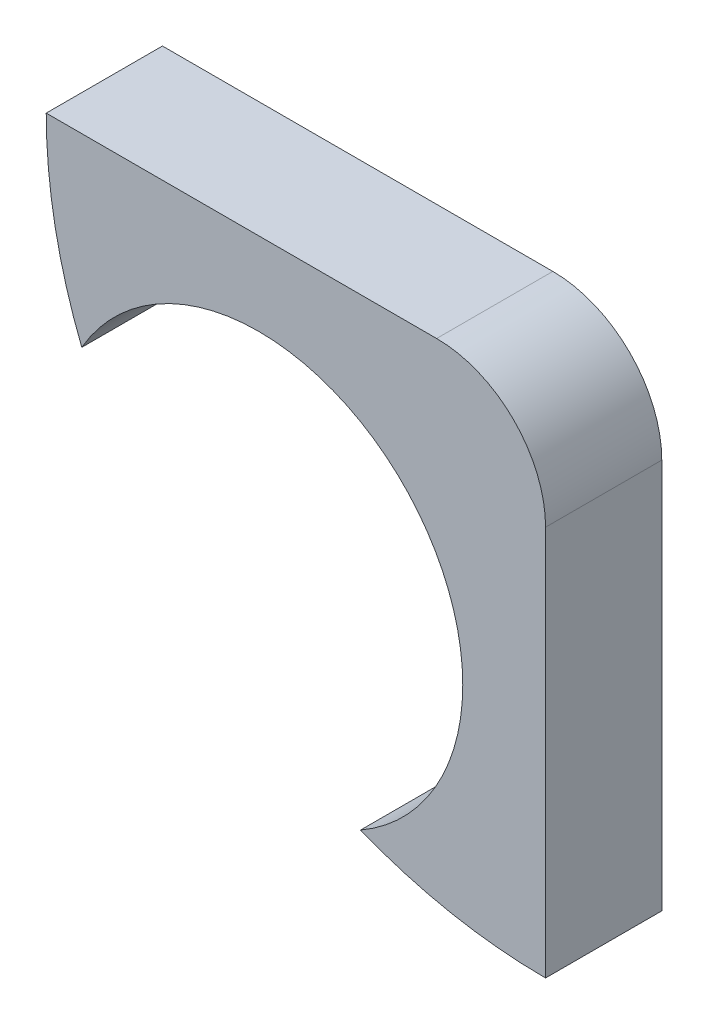
ISO-10303-21;
HEADER;
FILE_DESCRIPTION(('STEP AP214'),'2;1');
FILE_NAME('part.step','',(''),(''),'','','');
FILE_SCHEMA(('AUTOMOTIVE_DESIGN { 1 0 10303 214 1 1 1 1 }'));
ENDSEC;
DATA;
#1=APPLICATION_CONTEXT('core data for automotive mechanical design processes');
#2=APPLICATION_PROTOCOL_DEFINITION('international standard','automotive_design',2000,#1);
#3=PRODUCT_CONTEXT('',#1,'mechanical');
#4=PRODUCT('Part','Part','',(#3));
#5=PRODUCT_RELATED_PRODUCT_CATEGORY('part','',(#4));
#6=PRODUCT_DEFINITION_FORMATION('','',#4);
#7=PRODUCT_DEFINITION_CONTEXT('part definition',#1,'design');
#8=PRODUCT_DEFINITION('design','',#6,#7);
#9=PRODUCT_DEFINITION_SHAPE('','',#8);
#10=(LENGTH_UNIT() NAMED_UNIT(*) SI_UNIT(.MILLI.,.METRE.));
#11=(NAMED_UNIT(*) PLANE_ANGLE_UNIT() SI_UNIT($,.RADIAN.));
#12=(NAMED_UNIT(*) SI_UNIT($,.STERADIAN.) SOLID_ANGLE_UNIT());
#13=UNCERTAINTY_MEASURE_WITH_UNIT(LENGTH_MEASURE(1.E-05),#10,'distance_accuracy_value','');
#14=(GEOMETRIC_REPRESENTATION_CONTEXT(3) GLOBAL_UNCERTAINTY_ASSIGNED_CONTEXT((#13)) GLOBAL_UNIT_ASSIGNED_CONTEXT((#10,
#11,#12)) REPRESENTATION_CONTEXT('',''));
#15=CARTESIAN_POINT('',(0.,0.,0.));
#16=DIRECTION('',(0.,0.,1.));
#17=DIRECTION('',(1.,0.,0.));
#18=AXIS2_PLACEMENT_3D('',#15,#16,#17);
#19=CARTESIAN_POINT('',(18.45,18.45,1.));
#20=DIRECTION('',(0.,0.,-1.));
#21=DIRECTION('',(0.,-1.,0.));
#22=AXIS2_PLACEMENT_3D('',#19,#20,#21);
#23=PLANE('',#22);
#24=CARTESIAN_POINT('',(18.45,18.45,1.));
#25=DIRECTION('',(0.,0.,-1.));
#26=DIRECTION('',(-1.,0.,0.));
#27=AXIS2_PLACEMENT_3D('',#24,#25,#26);
#28=CIRCLE('',#27,1.5);
#29=CARTESIAN_POINT('',(18.45,19.95,1.));
#30=VERTEX_POINT('',#29);
#31=CARTESIAN_POINT('',(19.95,18.45,1.));
#32=VERTEX_POINT('',#31);
#33=EDGE_CURVE('E143',#30,#32,#28,.T.);
#34=ORIENTED_EDGE('',*,*,#33,.F.);
#35=DIRECTION('',(1.,0.,0.));
#36=VECTOR('',#35,1.);
#37=CARTESIAN_POINT('',(13.0749999999998,19.95,1.));
#38=LINE('',#37,#36);
#39=CARTESIAN_POINT('',(13.0749999999998,19.95,1.));
#40=VERTEX_POINT('',#39);
#41=EDGE_CURVE('E20',#40,#30,#38,.T.);
#42=ORIENTED_EDGE('',*,*,#41,.F.);
#43=CARTESIAN_POINT('',(19.95,19.95,1.));
#44=DIRECTION('',(0.,0.,-1.));
#45=DIRECTION('',(-1.,0.,0.));
#46=AXIS2_PLACEMENT_3D('',#43,#44,#45);
#47=CIRCLE('',#46,6.875);
#48=CARTESIAN_POINT('',(13.564657480385,17.4018583423996,1.));
#49=VERTEX_POINT('',#48);
#50=EDGE_CURVE('E138',#49,#40,#47,.T.);
#51=ORIENTED_EDGE('',*,*,#50,.F.);
#52=CARTESIAN_POINT('',(16.,16.,1.));
#53=DIRECTION('',(0.,0.,1.));
#54=DIRECTION('',(-1.,0.,0.));
#55=AXIS2_PLACEMENT_3D('',#52,#53,#54);
#56=CIRCLE('',#55,2.81);
#57=CARTESIAN_POINT('',(18.81,16.,1.));
#58=VERTEX_POINT('',#57);
#59=EDGE_CURVE('E121',#58,#49,#56,.T.);
#60=ORIENTED_EDGE('',*,*,#59,.F.);
#61=CARTESIAN_POINT('',(16.,16.,1.));
#62=DIRECTION('',(0.,0.,1.));
#63=DIRECTION('',(-1.,0.,0.));
#64=AXIS2_PLACEMENT_3D('',#61,#62,#63);
#65=CIRCLE('',#64,2.81);
#66=CARTESIAN_POINT('',(17.4018583423999,13.5646574803852,1.));
#67=VERTEX_POINT('',#66);
#68=EDGE_CURVE('E112',#67,#58,#65,.T.);
#69=ORIENTED_EDGE('',*,*,#68,.F.);
#70=CARTESIAN_POINT('',(19.95,19.95,1.));
#71=DIRECTION('',(0.,0.,-1.));
#72=DIRECTION('',(-1.,0.,0.));
#73=AXIS2_PLACEMENT_3D('',#70,#71,#72);
#74=CIRCLE('',#73,6.875);
#75=CARTESIAN_POINT('',(19.95,13.0750000000002,1.));
#76=VERTEX_POINT('',#75);
#77=EDGE_CURVE('E79',#76,#67,#74,.T.);
#78=ORIENTED_EDGE('',*,*,#77,.F.);
#79=DIRECTION('',(0.,-1.,0.));
#80=VECTOR('',#79,1.);
#81=CARTESIAN_POINT('',(19.95,18.45,1.));
#82=LINE('',#81,#80);
#83=EDGE_CURVE('E163',#32,#76,#82,.T.);
#84=ORIENTED_EDGE('',*,*,#83,.F.);
#85=EDGE_LOOP('',(#34,#42,#51,#60,#69,#78,#84));
#86=FACE_BOUND('',#85,.T.);
#87=ADVANCED_FACE('F16',(#86),#23,.F.);
#88=CARTESIAN_POINT('',(18.45,18.45,-0.6));
#89=DIRECTION('',(0.,0.,-1.));
#90=DIRECTION('',(0.,-1.,0.));
#91=AXIS2_PLACEMENT_3D('',#88,#89,#90);
#92=PLANE('',#91);
#93=CARTESIAN_POINT('',(18.45,18.45,-0.6));
#94=DIRECTION('',(0.,0.,-1.));
#95=DIRECTION('',(-1.,0.,0.));
#96=AXIS2_PLACEMENT_3D('',#93,#94,#95);
#97=CIRCLE('',#96,1.5);
#98=CARTESIAN_POINT('',(18.45,19.95,-0.6));
#99=VERTEX_POINT('',#98);
#100=CARTESIAN_POINT('',(19.95,18.45,-0.6));
#101=VERTEX_POINT('',#100);
#102=EDGE_CURVE('E142',#99,#101,#97,.T.);
#103=ORIENTED_EDGE('',*,*,#102,.T.);
#104=DIRECTION('',(0.,-1.,0.));
#105=VECTOR('',#104,1.);
#106=CARTESIAN_POINT('',(19.95,18.45,-0.6));
#107=LINE('',#106,#105);
#108=CARTESIAN_POINT('',(19.95,13.0750000000002,-0.6));
#109=VERTEX_POINT('',#108);
#110=EDGE_CURVE('E136',#101,#109,#107,.T.);
#111=ORIENTED_EDGE('',*,*,#110,.T.);
#112=CARTESIAN_POINT('',(19.95,19.95,-0.6));
#113=DIRECTION('',(0.,0.,-1.));
#114=DIRECTION('',(-1.,0.,0.));
#115=AXIS2_PLACEMENT_3D('',#112,#113,#114);
#116=CIRCLE('',#115,6.875);
#117=CARTESIAN_POINT('',(17.4018583423999,13.5646574803852,-0.6));
#118=VERTEX_POINT('',#117);
#119=EDGE_CURVE('E64',#109,#118,#116,.T.);
#120=ORIENTED_EDGE('',*,*,#119,.T.);
#121=CARTESIAN_POINT('',(16.,16.,-0.6));
#122=DIRECTION('',(0.,0.,1.));
#123=DIRECTION('',(-1.,0.,0.));
#124=AXIS2_PLACEMENT_3D('',#121,#122,#123);
#125=CIRCLE('',#124,2.81);
#126=CARTESIAN_POINT('',(18.81,16.,-0.6));
#127=VERTEX_POINT('',#126);
#128=EDGE_CURVE('E103',#118,#127,#125,.T.);
#129=ORIENTED_EDGE('',*,*,#128,.T.);
#130=CARTESIAN_POINT('',(16.,16.,-0.6));
#131=DIRECTION('',(0.,0.,1.));
#132=DIRECTION('',(-1.,0.,0.));
#133=AXIS2_PLACEMENT_3D('',#130,#131,#132);
#134=CIRCLE('',#133,2.81);
#135=CARTESIAN_POINT('',(13.564657480385,17.4018583423996,-0.6));
#136=VERTEX_POINT('',#135);
#137=EDGE_CURVE('E108',#127,#136,#134,.T.);
#138=ORIENTED_EDGE('',*,*,#137,.T.);
#139=CARTESIAN_POINT('',(19.95,19.95,-0.6));
#140=DIRECTION('',(0.,0.,-1.));
#141=DIRECTION('',(-1.,0.,0.));
#142=AXIS2_PLACEMENT_3D('',#139,#140,#141);
#143=CIRCLE('',#142,6.875);
#144=CARTESIAN_POINT('',(13.0749999999998,19.95,-0.6));
#145=VERTEX_POINT('',#144);
#146=EDGE_CURVE('E92',#136,#145,#143,.T.);
#147=ORIENTED_EDGE('',*,*,#146,.T.);
#148=DIRECTION('',(1.,0.,0.));
#149=VECTOR('',#148,1.);
#150=CARTESIAN_POINT('',(13.0749999999998,19.95,-0.6));
#151=LINE('',#150,#149);
#152=EDGE_CURVE('E11',#145,#99,#151,.T.);
#153=ORIENTED_EDGE('',*,*,#152,.T.);
#154=EDGE_LOOP('',(#103,#111,#120,#129,#138,#147,#153));
#155=FACE_BOUND('',#154,.T.);
#156=ADVANCED_FACE('F106',(#155),#92,.T.);
#157=CARTESIAN_POINT('',(13.0749999999998,19.95,-0.6));
#158=DIRECTION('',(0.,-1.,0.));
#159=DIRECTION('',(0.,0.,-1.));
#160=AXIS2_PLACEMENT_3D('',#157,#158,#159);
#161=PLANE('',#160);
#162=ORIENTED_EDGE('',*,*,#41,.T.);
#163=DIRECTION('',(0.,0.,1.));
#164=VECTOR('',#163,1.);
#165=CARTESIAN_POINT('',(18.45,19.95,-0.6));
#166=LINE('',#165,#164);
#167=EDGE_CURVE('E153',#99,#30,#166,.T.);
#168=ORIENTED_EDGE('',*,*,#167,.F.);
#169=ORIENTED_EDGE('',*,*,#152,.F.);
#170=DIRECTION('',(0.,0.,1.));
#171=VECTOR('',#170,1.);
#172=CARTESIAN_POINT('',(13.0749999999998,19.95,-0.6));
#173=LINE('',#172,#171);
#174=EDGE_CURVE('E167',#145,#40,#173,.T.);
#175=ORIENTED_EDGE('',*,*,#174,.T.);
#176=EDGE_LOOP('',(#162,#168,#169,#175));
#177=FACE_BOUND('',#176,.T.);
#178=ADVANCED_FACE('F285',(#177),#161,.F.);
#179=CARTESIAN_POINT('',(19.95,19.95,-0.6));
#180=DIRECTION('',(0.,0.,1.));
#181=DIRECTION('',(1.,0.,0.));
#182=AXIS2_PLACEMENT_3D('',#179,#180,#181);
#183=CYLINDRICAL_SURFACE('',#182,6.875);
#184=ORIENTED_EDGE('',*,*,#50,.T.);
#185=ORIENTED_EDGE('',*,*,#174,.F.);
#186=ORIENTED_EDGE('',*,*,#146,.F.);
#187=DIRECTION('',(0.,0.,1.));
#188=VECTOR('',#187,1.);
#189=CARTESIAN_POINT('',(13.564657480385,17.4018583423996,-0.6));
#190=LINE('',#189,#188);
#191=EDGE_CURVE('E124',#136,#49,#190,.T.);
#192=ORIENTED_EDGE('',*,*,#191,.T.);
#193=EDGE_LOOP('',(#184,#185,#186,#192));
#194=FACE_BOUND('',#193,.T.);
#195=ADVANCED_FACE('F288',(#194),#183,.T.);
#196=CARTESIAN_POINT('',(16.,16.,-0.6));
#197=DIRECTION('',(0.,0.,1.));
#198=DIRECTION('',(1.,0.,0.));
#199=AXIS2_PLACEMENT_3D('',#196,#197,#198);
#200=CYLINDRICAL_SURFACE('',#199,2.81);
#201=DIRECTION('',(0.,0.,1.));
#202=VECTOR('',#201,1.);
#203=CARTESIAN_POINT('',(18.81,16.,-0.6));
#204=LINE('',#203,#202);
#205=EDGE_CURVE('E115',#127,#58,#204,.T.);
#206=ORIENTED_EDGE('',*,*,#205,.F.);
#207=ORIENTED_EDGE('',*,*,#128,.F.);
#208=DIRECTION('',(0.,0.,1.));
#209=VECTOR('',#208,1.);
#210=CARTESIAN_POINT('',(17.4018583423999,13.5646574803852,-0.6));
#211=LINE('',#210,#209);
#212=EDGE_CURVE('E135',#118,#67,#211,.T.);
#213=ORIENTED_EDGE('',*,*,#212,.T.);
#214=ORIENTED_EDGE('',*,*,#68,.T.);
#215=EDGE_LOOP('',(#206,#207,#213,#214));
#216=FACE_BOUND('',#215,.T.);
#217=ADVANCED_FACE('F116',(#216),#200,.F.);
#218=CARTESIAN_POINT('',(19.95,19.95,-0.6));
#219=DIRECTION('',(0.,0.,1.));
#220=DIRECTION('',(1.,0.,0.));
#221=AXIS2_PLACEMENT_3D('',#218,#219,#220);
#222=CYLINDRICAL_SURFACE('',#221,6.875);
#223=ORIENTED_EDGE('',*,*,#77,.T.);
#224=ORIENTED_EDGE('',*,*,#212,.F.);
#225=ORIENTED_EDGE('',*,*,#119,.F.);
#226=DIRECTION('',(0.,0.,1.));
#227=VECTOR('',#226,1.);
#228=CARTESIAN_POINT('',(19.95,13.0750000000002,-0.6));
#229=LINE('',#228,#227);
#230=EDGE_CURVE('E179',#109,#76,#229,.T.);
#231=ORIENTED_EDGE('',*,*,#230,.T.);
#232=EDGE_LOOP('',(#223,#224,#225,#231));
#233=FACE_BOUND('',#232,.T.);
#234=ADVANCED_FACE('F18',(#233),#222,.T.);
#235=CARTESIAN_POINT('',(19.95,18.45,-0.6));
#236=DIRECTION('',(-1.,0.,0.));
#237=DIRECTION('',(0.,0.,1.));
#238=AXIS2_PLACEMENT_3D('',#235,#236,#237);
#239=PLANE('',#238);
#240=ORIENTED_EDGE('',*,*,#83,.T.);
#241=ORIENTED_EDGE('',*,*,#230,.F.);
#242=ORIENTED_EDGE('',*,*,#110,.F.);
#243=DIRECTION('',(0.,0.,1.));
#244=VECTOR('',#243,1.);
#245=CARTESIAN_POINT('',(19.95,18.45,-0.6));
#246=LINE('',#245,#244);
#247=EDGE_CURVE('E139',#101,#32,#246,.T.);
#248=ORIENTED_EDGE('',*,*,#247,.T.);
#249=EDGE_LOOP('',(#240,#241,#242,#248));
#250=FACE_BOUND('',#249,.T.);
#251=ADVANCED_FACE('F191',(#250),#239,.F.);
#252=CARTESIAN_POINT('',(18.45,18.45,-0.6));
#253=DIRECTION('',(0.,0.,1.));
#254=DIRECTION('',(1.,0.,0.));
#255=AXIS2_PLACEMENT_3D('',#252,#253,#254);
#256=CYLINDRICAL_SURFACE('',#255,1.5);
#257=ORIENTED_EDGE('',*,*,#33,.T.);
#258=ORIENTED_EDGE('',*,*,#247,.F.);
#259=ORIENTED_EDGE('',*,*,#102,.F.);
#260=ORIENTED_EDGE('',*,*,#167,.T.);
#261=EDGE_LOOP('',(#257,#258,#259,#260));
#262=FACE_BOUND('',#261,.T.);
#263=ADVANCED_FACE('F268',(#262),#256,.T.);
#264=CARTESIAN_POINT('',(16.,16.,-0.6));
#265=DIRECTION('',(0.,0.,1.));
#266=DIRECTION('',(1.,0.,0.));
#267=AXIS2_PLACEMENT_3D('',#264,#265,#266);
#268=CYLINDRICAL_SURFACE('',#267,2.81);
#269=ORIENTED_EDGE('',*,*,#137,.F.);
#270=ORIENTED_EDGE('',*,*,#205,.T.);
#271=ORIENTED_EDGE('',*,*,#59,.T.);
#272=ORIENTED_EDGE('',*,*,#191,.F.);
#273=EDGE_LOOP('',(#269,#270,#271,#272));
#274=FACE_BOUND('',#273,.T.);
#275=ADVANCED_FACE('F123',(#274),#268,.F.);
#276=CLOSED_SHELL('',(#87,#156,#178,#195,#217,#234,#251,#263,#275));
#277=MANIFOLD_SOLID_BREP('B1',#276);
#278=ADVANCED_BREP_SHAPE_REPRESENTATION('',(#18,#277),#14);
#279=SHAPE_DEFINITION_REPRESENTATION(#9,#278);
ENDSEC;
END-ISO-10303-21;
